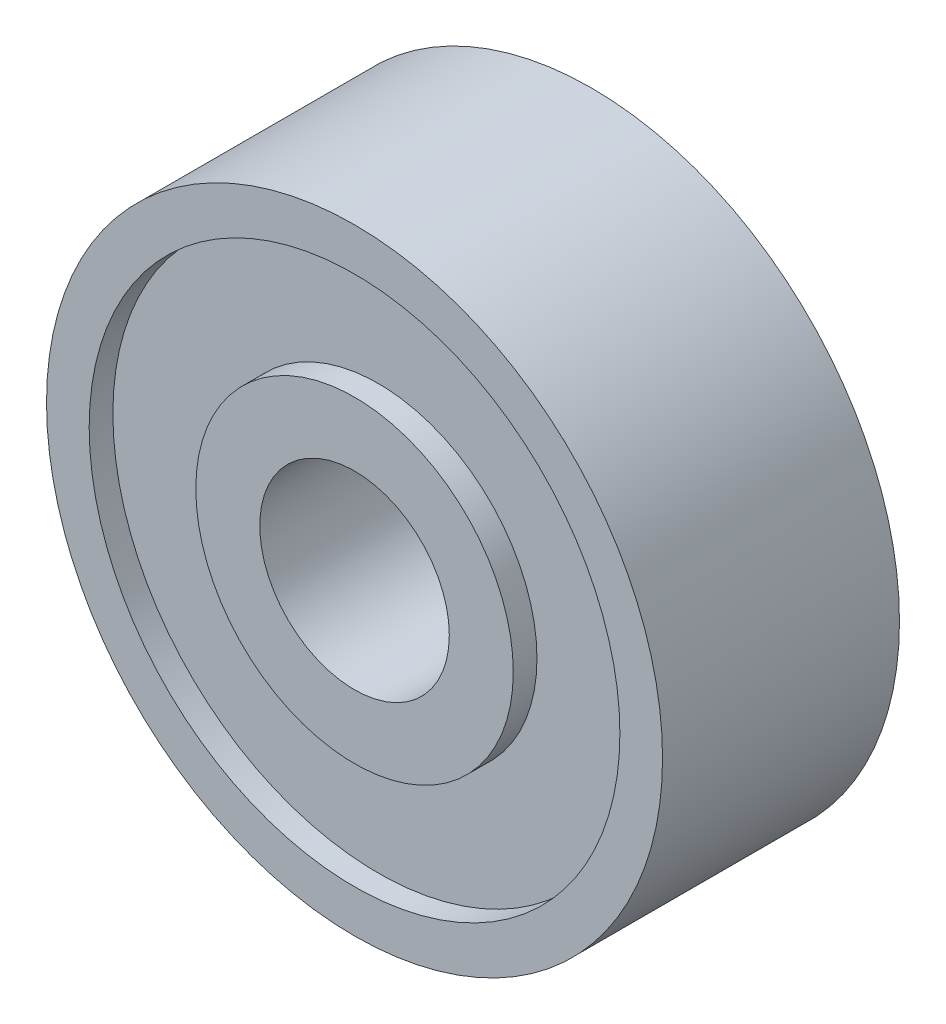
ISO-10303-21;
HEADER;
FILE_DESCRIPTION(('STEP AP214'),'2;1');
FILE_NAME('part.step','',(''),(''),'','','');
FILE_SCHEMA(('AUTOMOTIVE_DESIGN { 1 0 10303 214 1 1 1 1 }'));
ENDSEC;
DATA;
#1=APPLICATION_CONTEXT('core data for automotive mechanical design processes');
#2=APPLICATION_PROTOCOL_DEFINITION('international standard','automotive_design',2000,#1);
#3=PRODUCT_CONTEXT('',#1,'mechanical');
#4=PRODUCT('Part','Part','',(#3));
#5=PRODUCT_RELATED_PRODUCT_CATEGORY('part','',(#4));
#6=PRODUCT_DEFINITION_FORMATION('','',#4);
#7=PRODUCT_DEFINITION_CONTEXT('part definition',#1,'design');
#8=PRODUCT_DEFINITION('design','',#6,#7);
#9=PRODUCT_DEFINITION_SHAPE('','',#8);
#10=(LENGTH_UNIT() NAMED_UNIT(*) SI_UNIT(.MILLI.,.METRE.));
#11=(NAMED_UNIT(*) PLANE_ANGLE_UNIT() SI_UNIT($,.RADIAN.));
#12=(NAMED_UNIT(*) SI_UNIT($,.STERADIAN.) SOLID_ANGLE_UNIT());
#13=UNCERTAINTY_MEASURE_WITH_UNIT(LENGTH_MEASURE(1.E-05),#10,'distance_accuracy_value','');
#14=(GEOMETRIC_REPRESENTATION_CONTEXT(3) GLOBAL_UNCERTAINTY_ASSIGNED_CONTEXT((#13)) GLOBAL_UNIT_ASSIGNED_CONTEXT((#10,
#11,#12)) REPRESENTATION_CONTEXT('',''));
#15=CARTESIAN_POINT('',(0.,0.,0.));
#16=DIRECTION('',(0.,0.,1.));
#17=DIRECTION('',(1.,0.,0.));
#18=AXIS2_PLACEMENT_3D('',#15,#16,#17);
#19=CARTESIAN_POINT('',(0.,0.,0.));
#20=DIRECTION('',(0.,0.,1.));
#21=DIRECTION('',(1.,0.,0.));
#22=AXIS2_PLACEMENT_3D('',#19,#20,#21);
#23=PLANE('',#22);
#24=CARTESIAN_POINT('',(0.,0.,0.));
#25=DIRECTION('',(0.,0.,1.));
#26=DIRECTION('',(1.,0.,0.));
#27=AXIS2_PLACEMENT_3D('',#24,#25,#26);
#28=CIRCLE('',#27,2.);
#29=CARTESIAN_POINT('',(2.,0.,0.));
#30=VERTEX_POINT('',#29);
#31=EDGE_CURVE('E41',#30,#30,#28,.T.);
#32=ORIENTED_EDGE('',*,*,#31,.T.);
#33=EDGE_LOOP('',(#32));
#34=FACE_BOUND('',#33,.T.);
#35=CARTESIAN_POINT('',(0.,0.,0.));
#36=DIRECTION('',(0.,0.,-1.));
#37=DIRECTION('',(-1.,0.,0.));
#38=AXIS2_PLACEMENT_3D('',#35,#36,#37);
#39=CIRCLE('',#38,3.35);
#40=CARTESIAN_POINT('',(-3.35,0.,0.));
#41=VERTEX_POINT('',#40);
#42=EDGE_CURVE('E67',#41,#41,#39,.T.);
#43=ORIENTED_EDGE('',*,*,#42,.T.);
#44=EDGE_LOOP('',(#43));
#45=FACE_BOUND('',#44,.T.);
#46=ADVANCED_FACE('F30',(#34,#45),#23,.F.);
#47=CARTESIAN_POINT('',(0.,0.,5.));
#48=DIRECTION('',(0.,0.,1.));
#49=DIRECTION('',(1.,0.,0.));
#50=AXIS2_PLACEMENT_3D('',#47,#48,#49);
#51=PLANE('',#50);
#52=CARTESIAN_POINT('',(0.,0.,5.));
#53=DIRECTION('',(0.,0.,1.));
#54=DIRECTION('',(1.,0.,0.));
#55=AXIS2_PLACEMENT_3D('',#52,#53,#54);
#56=CIRCLE('',#55,2.);
#57=CARTESIAN_POINT('',(2.,0.,5.));
#58=VERTEX_POINT('',#57);
#59=EDGE_CURVE('E43',#58,#58,#56,.T.);
#60=ORIENTED_EDGE('',*,*,#59,.F.);
#61=EDGE_LOOP('',(#60));
#62=FACE_BOUND('',#61,.T.);
#63=CARTESIAN_POINT('',(0.,0.,5.));
#64=DIRECTION('',(0.,0.,1.));
#65=DIRECTION('',(1.,0.,0.));
#66=AXIS2_PLACEMENT_3D('',#63,#64,#65);
#67=CIRCLE('',#66,3.35);
#68=CARTESIAN_POINT('',(3.35,0.,5.));
#69=VERTEX_POINT('',#68);
#70=EDGE_CURVE('E55',#69,#69,#67,.T.);
#71=ORIENTED_EDGE('',*,*,#70,.T.);
#72=EDGE_LOOP('',(#71));
#73=FACE_BOUND('',#72,.T.);
#74=ADVANCED_FACE('F97',(#62,#73),#51,.T.);
#75=CARTESIAN_POINT('',(0.,0.,5.));
#76=DIRECTION('',(0.,0.,-1.));
#77=DIRECTION('',(-1.,0.,0.));
#78=AXIS2_PLACEMENT_3D('',#75,#76,#77);
#79=CYLINDRICAL_SURFACE('',#78,6.5);
#80=CARTESIAN_POINT('',(0.,0.,5.));
#81=DIRECTION('',(0.,0.,1.));
#82=DIRECTION('',(1.,0.,0.));
#83=AXIS2_PLACEMENT_3D('',#80,#81,#82);
#84=CIRCLE('',#83,6.5);
#85=CARTESIAN_POINT('',(6.5,0.,5.));
#86=VERTEX_POINT('',#85);
#87=EDGE_CURVE('E10',#86,#86,#84,.T.);
#88=ORIENTED_EDGE('',*,*,#87,.F.);
#89=EDGE_LOOP('',(#88));
#90=FACE_BOUND('',#89,.T.);
#91=CARTESIAN_POINT('',(0.,0.,0.));
#92=DIRECTION('',(0.,0.,1.));
#93=DIRECTION('',(1.,0.,0.));
#94=AXIS2_PLACEMENT_3D('',#91,#92,#93);
#95=CIRCLE('',#94,6.5);
#96=CARTESIAN_POINT('',(6.5,0.,0.));
#97=VERTEX_POINT('',#96);
#98=EDGE_CURVE('E34',#97,#97,#95,.T.);
#99=ORIENTED_EDGE('',*,*,#98,.T.);
#100=EDGE_LOOP('',(#99));
#101=FACE_BOUND('',#100,.T.);
#102=ADVANCED_FACE('F32',(#90,#101),#79,.T.);
#103=CARTESIAN_POINT('',(0.,0.,5.));
#104=DIRECTION('',(0.,0.,1.));
#105=DIRECTION('',(1.,0.,0.));
#106=AXIS2_PLACEMENT_3D('',#103,#104,#105);
#107=CIRCLE('',#106,5.6);
#108=CARTESIAN_POINT('',(5.6,0.,5.));
#109=VERTEX_POINT('',#108);
#110=EDGE_CURVE('E49',#109,#109,#107,.T.);
#111=ORIENTED_EDGE('',*,*,#110,.F.);
#112=EDGE_LOOP('',(#111));
#113=FACE_BOUND('',#112,.T.);
#114=ORIENTED_EDGE('',*,*,#87,.T.);
#115=EDGE_LOOP('',(#114));
#116=FACE_BOUND('',#115,.T.);
#117=ADVANCED_FACE('F93',(#113,#116),#51,.T.);
#118=CARTESIAN_POINT('',(0.,0.,0.));
#119=DIRECTION('',(0.,0.,-1.));
#120=DIRECTION('',(-1.,0.,0.));
#121=AXIS2_PLACEMENT_3D('',#118,#119,#120);
#122=CIRCLE('',#121,5.6);
#123=CARTESIAN_POINT('',(-5.6,0.,0.));
#124=VERTEX_POINT('',#123);
#125=EDGE_CURVE('E61',#124,#124,#122,.T.);
#126=ORIENTED_EDGE('',*,*,#125,.F.);
#127=EDGE_LOOP('',(#126));
#128=FACE_BOUND('',#127,.T.);
#129=ORIENTED_EDGE('',*,*,#98,.F.);
#130=EDGE_LOOP('',(#129));
#131=FACE_BOUND('',#130,.T.);
#132=ADVANCED_FACE('F89',(#128,#131),#23,.F.);
#133=CARTESIAN_POINT('',(0.,0.,0.));
#134=DIRECTION('',(0.,0.,1.));
#135=DIRECTION('',(1.,0.,0.));
#136=AXIS2_PLACEMENT_3D('',#133,#134,#135);
#137=CYLINDRICAL_SURFACE('',#136,2.);
#138=ORIENTED_EDGE('',*,*,#31,.F.);
#139=EDGE_LOOP('',(#138));
#140=FACE_BOUND('',#139,.T.);
#141=ORIENTED_EDGE('',*,*,#59,.T.);
#142=EDGE_LOOP('',(#141));
#143=FACE_BOUND('',#142,.T.);
#144=ADVANCED_FACE('F92',(#140,#143),#137,.F.);
#145=CARTESIAN_POINT('',(0.,0.,4.5));
#146=DIRECTION('',(0.,0.,1.));
#147=DIRECTION('',(1.,0.,0.));
#148=AXIS2_PLACEMENT_3D('',#145,#146,#147);
#149=CYLINDRICAL_SURFACE('',#148,5.6);
#150=CARTESIAN_POINT('',(0.,0.,4.5));
#151=DIRECTION('',(0.,0.,1.));
#152=DIRECTION('',(1.,0.,0.));
#153=AXIS2_PLACEMENT_3D('',#150,#151,#152);
#154=CIRCLE('',#153,5.6);
#155=CARTESIAN_POINT('',(5.6,0.,4.5));
#156=VERTEX_POINT('',#155);
#157=EDGE_CURVE('E46',#156,#156,#154,.T.);
#158=ORIENTED_EDGE('',*,*,#157,.F.);
#159=EDGE_LOOP('',(#158));
#160=FACE_BOUND('',#159,.T.);
#161=ORIENTED_EDGE('',*,*,#110,.T.);
#162=EDGE_LOOP('',(#161));
#163=FACE_BOUND('',#162,.T.);
#164=ADVANCED_FACE('F114',(#160,#163),#149,.F.);
#165=CARTESIAN_POINT('',(0.,0.,4.5));
#166=DIRECTION('',(0.,0.,1.));
#167=DIRECTION('',(1.,0.,0.));
#168=AXIS2_PLACEMENT_3D('',#165,#166,#167);
#169=PLANE('',#168);
#170=CARTESIAN_POINT('',(0.,0.,4.5));
#171=DIRECTION('',(0.,0.,1.));
#172=DIRECTION('',(1.,0.,0.));
#173=AXIS2_PLACEMENT_3D('',#170,#171,#172);
#174=CIRCLE('',#173,3.35);
#175=CARTESIAN_POINT('',(3.35,0.,4.5));
#176=VERTEX_POINT('',#175);
#177=EDGE_CURVE('E52',#176,#176,#174,.T.);
#178=ORIENTED_EDGE('',*,*,#177,.F.);
#179=EDGE_LOOP('',(#178));
#180=FACE_BOUND('',#179,.T.);
#181=ORIENTED_EDGE('',*,*,#157,.T.);
#182=EDGE_LOOP('',(#181));
#183=FACE_BOUND('',#182,.T.);
#184=ADVANCED_FACE('F118',(#180,#183),#169,.T.);
#185=CARTESIAN_POINT('',(0.,0.,4.5));
#186=DIRECTION('',(0.,0.,1.));
#187=DIRECTION('',(1.,0.,0.));
#188=AXIS2_PLACEMENT_3D('',#185,#186,#187);
#189=CYLINDRICAL_SURFACE('',#188,3.35);
#190=ORIENTED_EDGE('',*,*,#177,.T.);
#191=EDGE_LOOP('',(#190));
#192=FACE_BOUND('',#191,.T.);
#193=ORIENTED_EDGE('',*,*,#70,.F.);
#194=EDGE_LOOP('',(#193));
#195=FACE_BOUND('',#194,.T.);
#196=ADVANCED_FACE('F85',(#192,#195),#189,.T.);
#197=CARTESIAN_POINT('',(0.,0.,0.5));
#198=DIRECTION('',(0.,0.,-1.));
#199=DIRECTION('',(-1.,0.,0.));
#200=AXIS2_PLACEMENT_3D('',#197,#198,#199);
#201=CYLINDRICAL_SURFACE('',#200,5.6);
#202=CARTESIAN_POINT('',(0.,0.,0.5));
#203=DIRECTION('',(0.,0.,-1.));
#204=DIRECTION('',(-1.,0.,0.));
#205=AXIS2_PLACEMENT_3D('',#202,#203,#204);
#206=CIRCLE('',#205,5.6);
#207=CARTESIAN_POINT('',(-5.6,0.,0.5));
#208=VERTEX_POINT('',#207);
#209=EDGE_CURVE('E58',#208,#208,#206,.T.);
#210=ORIENTED_EDGE('',*,*,#209,.F.);
#211=EDGE_LOOP('',(#210));
#212=FACE_BOUND('',#211,.T.);
#213=ORIENTED_EDGE('',*,*,#125,.T.);
#214=EDGE_LOOP('',(#213));
#215=FACE_BOUND('',#214,.T.);
#216=ADVANCED_FACE('F79',(#212,#215),#201,.F.);
#217=CARTESIAN_POINT('',(0.,0.,0.5));
#218=DIRECTION('',(0.,0.,-1.));
#219=DIRECTION('',(-1.,0.,0.));
#220=AXIS2_PLACEMENT_3D('',#217,#218,#219);
#221=PLANE('',#220);
#222=CARTESIAN_POINT('',(0.,0.,0.5));
#223=DIRECTION('',(0.,0.,-1.));
#224=DIRECTION('',(-1.,0.,0.));
#225=AXIS2_PLACEMENT_3D('',#222,#223,#224);
#226=CIRCLE('',#225,3.35);
#227=CARTESIAN_POINT('',(-3.35,0.,0.5));
#228=VERTEX_POINT('',#227);
#229=EDGE_CURVE('E64',#228,#228,#226,.T.);
#230=ORIENTED_EDGE('',*,*,#229,.F.);
#231=EDGE_LOOP('',(#230));
#232=FACE_BOUND('',#231,.T.);
#233=ORIENTED_EDGE('',*,*,#209,.T.);
#234=EDGE_LOOP('',(#233));
#235=FACE_BOUND('',#234,.T.);
#236=ADVANCED_FACE('F76',(#232,#235),#221,.T.);
#237=CARTESIAN_POINT('',(0.,0.,0.5));
#238=DIRECTION('',(0.,0.,-1.));
#239=DIRECTION('',(-1.,0.,0.));
#240=AXIS2_PLACEMENT_3D('',#237,#238,#239);
#241=CYLINDRICAL_SURFACE('',#240,3.35);
#242=ORIENTED_EDGE('',*,*,#229,.T.);
#243=EDGE_LOOP('',(#242));
#244=FACE_BOUND('',#243,.T.);
#245=ORIENTED_EDGE('',*,*,#42,.F.);
#246=EDGE_LOOP('',(#245));
#247=FACE_BOUND('',#246,.T.);
#248=ADVANCED_FACE('F73',(#244,#247),#241,.T.);
#249=CLOSED_SHELL('',(#46,#74,#102,#117,#132,#144,#164,#184,#196,#216,#236,#248));
#250=MANIFOLD_SOLID_BREP('B2',#249);
#251=ADVANCED_BREP_SHAPE_REPRESENTATION('',(#18,#250),#14);
#252=SHAPE_DEFINITION_REPRESENTATION(#9,#251);
ENDSEC;
END-ISO-10303-21;
